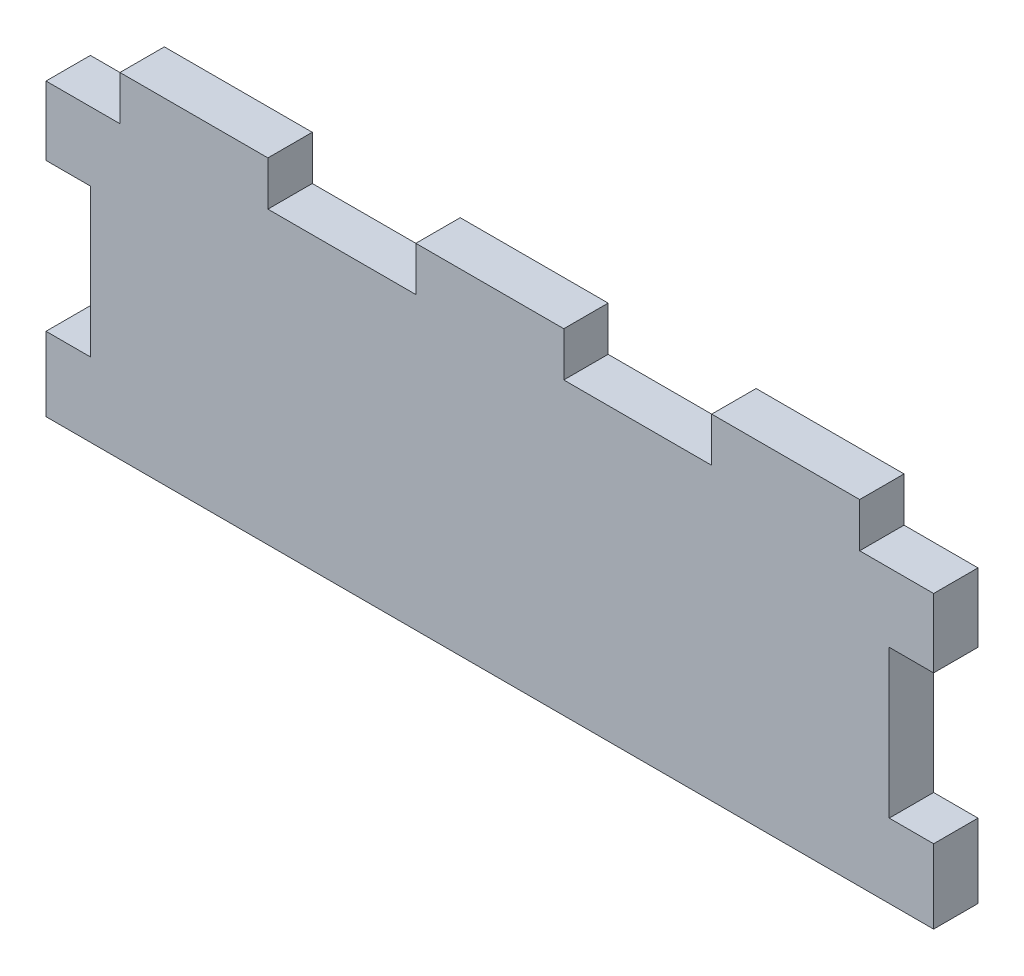
ISO-10303-21;
HEADER;
FILE_DESCRIPTION(('STEP AP214'),'2;1');
FILE_NAME('part.step','',(''),(''),'','','');
FILE_SCHEMA(('AUTOMOTIVE_DESIGN { 1 0 10303 214 1 1 1 1 }'));
ENDSEC;
DATA;
#1=APPLICATION_CONTEXT('core data for automotive mechanical design processes');
#2=APPLICATION_PROTOCOL_DEFINITION('international standard','automotive_design',2000,#1);
#3=PRODUCT_CONTEXT('',#1,'mechanical');
#4=PRODUCT('Part','Part','',(#3));
#5=PRODUCT_RELATED_PRODUCT_CATEGORY('part','',(#4));
#6=PRODUCT_DEFINITION_FORMATION('','',#4);
#7=PRODUCT_DEFINITION_CONTEXT('part definition',#1,'design');
#8=PRODUCT_DEFINITION('design','',#6,#7);
#9=PRODUCT_DEFINITION_SHAPE('','',#8);
#10=(LENGTH_UNIT() NAMED_UNIT(*) SI_UNIT(.MILLI.,.METRE.));
#11=(NAMED_UNIT(*) PLANE_ANGLE_UNIT() SI_UNIT($,.RADIAN.));
#12=(NAMED_UNIT(*) SI_UNIT($,.STERADIAN.) SOLID_ANGLE_UNIT());
#13=UNCERTAINTY_MEASURE_WITH_UNIT(LENGTH_MEASURE(1.E-05),#10,'distance_accuracy_value','');
#14=(GEOMETRIC_REPRESENTATION_CONTEXT(3) GLOBAL_UNCERTAINTY_ASSIGNED_CONTEXT((#13)) GLOBAL_UNIT_ASSIGNED_CONTEXT((#10,
#11,#12)) REPRESENTATION_CONTEXT('',''));
#15=CARTESIAN_POINT('',(0.,0.,0.));
#16=DIRECTION('',(0.,0.,1.));
#17=DIRECTION('',(1.,0.,0.));
#18=AXIS2_PLACEMENT_3D('',#15,#16,#17);
#19=CARTESIAN_POINT('',(0.,0.,6.));
#20=DIRECTION('',(1.,0.,0.));
#21=DIRECTION('',(0.,1.,0.));
#22=AXIS2_PLACEMENT_3D('',#19,#20,#21);
#23=PLANE('',#22);
#24=DIRECTION('',(0.,-1.,0.));
#25=VECTOR('',#24,1.);
#26=CARTESIAN_POINT('',(0.,0.,0.));
#27=LINE('',#26,#25);
#28=CARTESIAN_POINT('',(0.,-6.,0.));
#29=VERTEX_POINT('',#28);
#30=CARTESIAN_POINT('',(0.,-15.3,0.));
#31=VERTEX_POINT('',#30);
#32=EDGE_CURVE('E248',#29,#31,#27,.T.);
#33=ORIENTED_EDGE('',*,*,#32,.T.);
#34=DIRECTION('',(0.,0.,1.));
#35=VECTOR('',#34,1.);
#36=CARTESIAN_POINT('',(0.,-15.3,0.));
#37=LINE('',#36,#35);
#38=CARTESIAN_POINT('',(0.,-15.3,6.));
#39=VERTEX_POINT('',#38);
#40=EDGE_CURVE('E360',#31,#39,#37,.T.);
#41=ORIENTED_EDGE('',*,*,#40,.T.);
#42=DIRECTION('',(0.,-1.,0.));
#43=VECTOR('',#42,1.);
#44=CARTESIAN_POINT('',(0.,0.,6.));
#45=LINE('',#44,#43);
#46=CARTESIAN_POINT('',(0.,-6.,6.));
#47=VERTEX_POINT('',#46);
#48=EDGE_CURVE('E228',#47,#39,#45,.T.);
#49=ORIENTED_EDGE('',*,*,#48,.F.);
#50=DIRECTION('',(0.,0.,1.));
#51=VECTOR('',#50,1.);
#52=CARTESIAN_POINT('',(0.,-6.,0.));
#53=LINE('',#52,#51);
#54=EDGE_CURVE('E262',#29,#47,#53,.T.);
#55=ORIENTED_EDGE('',*,*,#54,.F.);
#56=EDGE_LOOP('',(#33,#41,#49,#55));
#57=FACE_BOUND('',#56,.T.);
#58=ADVANCED_FACE('F35',(#57),#23,.F.);
#59=CARTESIAN_POINT('',(120.,0.,6.));
#60=DIRECTION('',(-1.,0.,0.));
#61=DIRECTION('',(0.,0.,1.));
#62=AXIS2_PLACEMENT_3D('',#59,#60,#61);
#63=PLANE('',#62);
#64=DIRECTION('',(0.,1.,0.));
#65=VECTOR('',#64,1.);
#66=CARTESIAN_POINT('',(120.,0.,6.));
#67=LINE('',#66,#65);
#68=CARTESIAN_POINT('',(120.,-15.3,6.));
#69=VERTEX_POINT('',#68);
#70=CARTESIAN_POINT('',(120.,-5.99999999999999,6.));
#71=VERTEX_POINT('',#70);
#72=EDGE_CURVE('E258',#69,#71,#67,.T.);
#73=ORIENTED_EDGE('',*,*,#72,.F.);
#74=DIRECTION('',(0.,0.,1.));
#75=VECTOR('',#74,1.);
#76=CARTESIAN_POINT('',(120.,-15.3,0.));
#77=LINE('',#76,#75);
#78=CARTESIAN_POINT('',(120.,-15.3,0.));
#79=VERTEX_POINT('',#78);
#80=EDGE_CURVE('E335',#79,#69,#77,.T.);
#81=ORIENTED_EDGE('',*,*,#80,.F.);
#82=DIRECTION('',(0.,1.,0.));
#83=VECTOR('',#82,1.);
#84=CARTESIAN_POINT('',(120.,0.,0.));
#85=LINE('',#84,#83);
#86=CARTESIAN_POINT('',(120.,-5.99999999999999,0.));
#87=VERTEX_POINT('',#86);
#88=EDGE_CURVE('E239',#79,#87,#85,.T.);
#89=ORIENTED_EDGE('',*,*,#88,.T.);
#90=DIRECTION('',(0.,0.,1.));
#91=VECTOR('',#90,1.);
#92=CARTESIAN_POINT('',(120.,-5.99999999999999,0.));
#93=LINE('',#92,#91);
#94=EDGE_CURVE('E299',#87,#71,#93,.T.);
#95=ORIENTED_EDGE('',*,*,#94,.T.);
#96=EDGE_LOOP('',(#73,#81,#89,#95));
#97=FACE_BOUND('',#96,.T.);
#98=ADVANCED_FACE('F386',(#97),#63,.F.);
#99=CARTESIAN_POINT('',(0.,0.,6.));
#100=DIRECTION('',(0.,-1.,0.));
#101=DIRECTION('',(0.,0.,-1.));
#102=AXIS2_PLACEMENT_3D('',#99,#100,#101);
#103=PLANE('',#102);
#104=DIRECTION('',(-1.,0.,0.));
#105=VECTOR('',#104,1.);
#106=CARTESIAN_POINT('',(0.,0.,6.));
#107=LINE('',#106,#105);
#108=CARTESIAN_POINT('',(110.,0.,6.));
#109=VERTEX_POINT('',#108);
#110=CARTESIAN_POINT('',(90.,0.,6.));
#111=VERTEX_POINT('',#110);
#112=EDGE_CURVE('E216',#109,#111,#107,.T.);
#113=ORIENTED_EDGE('',*,*,#112,.F.);
#114=DIRECTION('',(0.,0.,1.));
#115=VECTOR('',#114,1.);
#116=CARTESIAN_POINT('',(110.,0.,0.));
#117=LINE('',#116,#115);
#118=CARTESIAN_POINT('',(110.,0.,0.));
#119=VERTEX_POINT('',#118);
#120=EDGE_CURVE('E200',#119,#109,#117,.T.);
#121=ORIENTED_EDGE('',*,*,#120,.F.);
#122=DIRECTION('',(-1.,0.,0.));
#123=VECTOR('',#122,1.);
#124=CARTESIAN_POINT('',(0.,0.,0.));
#125=LINE('',#124,#123);
#126=CARTESIAN_POINT('',(90.,0.,0.));
#127=VERTEX_POINT('',#126);
#128=EDGE_CURVE('E214',#119,#127,#125,.T.);
#129=ORIENTED_EDGE('',*,*,#128,.T.);
#130=DIRECTION('',(0.,0.,1.));
#131=VECTOR('',#130,1.);
#132=CARTESIAN_POINT('',(90.,0.,0.));
#133=LINE('',#132,#131);
#134=EDGE_CURVE('E287',#127,#111,#133,.T.);
#135=ORIENTED_EDGE('',*,*,#134,.T.);
#136=EDGE_LOOP('',(#113,#121,#129,#135));
#137=FACE_BOUND('',#136,.T.);
#138=ADVANCED_FACE('F212',(#137),#103,.F.);
#139=CARTESIAN_POINT('',(30.,0.,6.));
#140=VERTEX_POINT('',#139);
#141=CARTESIAN_POINT('',(10.,0.,6.));
#142=VERTEX_POINT('',#141);
#143=EDGE_CURVE('E252',#140,#142,#107,.T.);
#144=ORIENTED_EDGE('',*,*,#143,.F.);
#145=DIRECTION('',(0.,0.,1.));
#146=VECTOR('',#145,1.);
#147=CARTESIAN_POINT('',(30.,0.,0.));
#148=LINE('',#147,#146);
#149=CARTESIAN_POINT('',(30.,0.,0.));
#150=VERTEX_POINT('',#149);
#151=EDGE_CURVE('E276',#150,#140,#148,.T.);
#152=ORIENTED_EDGE('',*,*,#151,.F.);
#153=CARTESIAN_POINT('',(10.,0.,0.));
#154=VERTEX_POINT('',#153);
#155=EDGE_CURVE('E227',#150,#154,#125,.T.);
#156=ORIENTED_EDGE('',*,*,#155,.T.);
#157=DIRECTION('',(0.,0.,1.));
#158=VECTOR('',#157,1.);
#159=CARTESIAN_POINT('',(10.,0.,0.));
#160=LINE('',#159,#158);
#161=EDGE_CURVE('E267',#154,#142,#160,.T.);
#162=ORIENTED_EDGE('',*,*,#161,.T.);
#163=EDGE_LOOP('',(#144,#152,#156,#162));
#164=FACE_BOUND('',#163,.T.);
#165=ADVANCED_FACE('F430',(#164),#103,.F.);
#166=CARTESIAN_POINT('',(0.,-35.3,6.));
#167=VERTEX_POINT('',#166);
#168=CARTESIAN_POINT('',(0.,-45.3,6.));
#169=VERTEX_POINT('',#168);
#170=EDGE_CURVE('E224',#167,#169,#45,.T.);
#171=ORIENTED_EDGE('',*,*,#170,.F.);
#172=DIRECTION('',(0.,0.,1.));
#173=VECTOR('',#172,1.);
#174=CARTESIAN_POINT('',(0.,-35.3,0.));
#175=LINE('',#174,#173);
#176=CARTESIAN_POINT('',(0.,-35.3,0.));
#177=VERTEX_POINT('',#176);
#178=EDGE_CURVE('E353',#177,#167,#175,.T.);
#179=ORIENTED_EDGE('',*,*,#178,.F.);
#180=CARTESIAN_POINT('',(0.,-45.3,0.));
#181=VERTEX_POINT('',#180);
#182=EDGE_CURVE('E251',#177,#181,#27,.T.);
#183=ORIENTED_EDGE('',*,*,#182,.T.);
#184=DIRECTION('',(0.,0.,-1.));
#185=VECTOR('',#184,1.);
#186=CARTESIAN_POINT('',(0.,-45.3,6.));
#187=LINE('',#186,#185);
#188=EDGE_CURVE('E11',#169,#181,#187,.T.);
#189=ORIENTED_EDGE('',*,*,#188,.F.);
#190=EDGE_LOOP('',(#171,#179,#183,#189));
#191=FACE_BOUND('',#190,.T.);
#192=ADVANCED_FACE('F37',(#191),#23,.F.);
#193=CARTESIAN_POINT('',(0.,-45.3,6.));
#194=DIRECTION('',(0.,1.,0.));
#195=DIRECTION('',(0.,0.,1.));
#196=AXIS2_PLACEMENT_3D('',#193,#194,#195);
#197=PLANE('',#196);
#198=DIRECTION('',(1.,0.,0.));
#199=VECTOR('',#198,1.);
#200=CARTESIAN_POINT('',(0.,-45.3,0.));
#201=LINE('',#200,#199);
#202=CARTESIAN_POINT('',(120.,-45.3,0.));
#203=VERTEX_POINT('',#202);
#204=EDGE_CURVE('E245',#181,#203,#201,.T.);
#205=ORIENTED_EDGE('',*,*,#204,.T.);
#206=DIRECTION('',(0.,0.,-1.));
#207=VECTOR('',#206,1.);
#208=CARTESIAN_POINT('',(120.,-45.3,6.));
#209=LINE('',#208,#207);
#210=CARTESIAN_POINT('',(120.,-45.3,6.));
#211=VERTEX_POINT('',#210);
#212=EDGE_CURVE('E43',#211,#203,#209,.T.);
#213=ORIENTED_EDGE('',*,*,#212,.F.);
#214=DIRECTION('',(1.,0.,0.));
#215=VECTOR('',#214,1.);
#216=CARTESIAN_POINT('',(0.,-45.3,6.));
#217=LINE('',#216,#215);
#218=EDGE_CURVE('E259',#169,#211,#217,.T.);
#219=ORIENTED_EDGE('',*,*,#218,.F.);
#220=ORIENTED_EDGE('',*,*,#188,.T.);
#221=EDGE_LOOP('',(#205,#213,#219,#220));
#222=FACE_BOUND('',#221,.T.);
#223=ADVANCED_FACE('F405',(#222),#197,.F.);
#224=CARTESIAN_POINT('',(120.,-35.3,0.));
#225=VERTEX_POINT('',#224);
#226=EDGE_CURVE('E232',#203,#225,#85,.T.);
#227=ORIENTED_EDGE('',*,*,#226,.T.);
#228=DIRECTION('',(0.,0.,1.));
#229=VECTOR('',#228,1.);
#230=CARTESIAN_POINT('',(120.,-35.3,0.));
#231=LINE('',#230,#229);
#232=CARTESIAN_POINT('',(120.,-35.3,6.));
#233=VERTEX_POINT('',#232);
#234=EDGE_CURVE('E333',#225,#233,#231,.T.);
#235=ORIENTED_EDGE('',*,*,#234,.T.);
#236=EDGE_CURVE('E255',#211,#233,#67,.T.);
#237=ORIENTED_EDGE('',*,*,#236,.F.);
#238=ORIENTED_EDGE('',*,*,#212,.T.);
#239=EDGE_LOOP('',(#227,#235,#237,#238));
#240=FACE_BOUND('',#239,.T.);
#241=ADVANCED_FACE('F458',(#240),#63,.F.);
#242=CARTESIAN_POINT('',(70.,0.,6.));
#243=VERTEX_POINT('',#242);
#244=CARTESIAN_POINT('',(50.,0.,6.));
#245=VERTEX_POINT('',#244);
#246=EDGE_CURVE('E254',#243,#245,#107,.T.);
#247=ORIENTED_EDGE('',*,*,#246,.F.);
#248=DIRECTION('',(0.,0.,1.));
#249=VECTOR('',#248,1.);
#250=CARTESIAN_POINT('',(70.,0.,0.));
#251=LINE('',#250,#249);
#252=CARTESIAN_POINT('',(70.,0.,0.));
#253=VERTEX_POINT('',#252);
#254=EDGE_CURVE('E281',#253,#243,#251,.T.);
#255=ORIENTED_EDGE('',*,*,#254,.F.);
#256=CARTESIAN_POINT('',(50.,0.,0.));
#257=VERTEX_POINT('',#256);
#258=EDGE_CURVE('E225',#253,#257,#125,.T.);
#259=ORIENTED_EDGE('',*,*,#258,.T.);
#260=DIRECTION('',(0.,0.,1.));
#261=VECTOR('',#260,1.);
#262=CARTESIAN_POINT('',(50.,0.,0.));
#263=LINE('',#262,#261);
#264=EDGE_CURVE('E310',#257,#245,#263,.T.);
#265=ORIENTED_EDGE('',*,*,#264,.T.);
#266=EDGE_LOOP('',(#247,#255,#259,#265));
#267=FACE_BOUND('',#266,.T.);
#268=ADVANCED_FACE('F445',(#267),#103,.F.);
#269=CARTESIAN_POINT('',(0.,0.,6.));
#270=DIRECTION('',(0.,0.,1.));
#271=DIRECTION('',(1.,0.,0.));
#272=AXIS2_PLACEMENT_3D('',#269,#270,#271);
#273=PLANE('',#272);
#274=DIRECTION('',(-1.,0.,0.));
#275=VECTOR('',#274,1.);
#276=CARTESIAN_POINT('',(114.,-15.3,6.));
#277=LINE('',#276,#275);
#278=CARTESIAN_POINT('',(114.,-15.3,6.));
#279=VERTEX_POINT('',#278);
#280=EDGE_CURVE('E344',#69,#279,#277,.T.);
#281=ORIENTED_EDGE('',*,*,#280,.F.);
#282=ORIENTED_EDGE('',*,*,#72,.T.);
#283=DIRECTION('',(1.,0.,0.));
#284=VECTOR('',#283,1.);
#285=CARTESIAN_POINT('',(120.,-5.99999999999999,6.));
#286=LINE('',#285,#284);
#287=CARTESIAN_POINT('',(110.,-5.99999999999999,6.));
#288=VERTEX_POINT('',#287);
#289=EDGE_CURVE('E207',#288,#71,#286,.T.);
#290=ORIENTED_EDGE('',*,*,#289,.F.);
#291=DIRECTION('',(0.,-1.,0.));
#292=VECTOR('',#291,1.);
#293=CARTESIAN_POINT('',(110.,0.,6.));
#294=LINE('',#293,#292);
#295=EDGE_CURVE('E363',#109,#288,#294,.T.);
#296=ORIENTED_EDGE('',*,*,#295,.F.);
#297=ORIENTED_EDGE('',*,*,#112,.T.);
#298=DIRECTION('',(0.,1.,0.));
#299=VECTOR('',#298,1.);
#300=CARTESIAN_POINT('',(90.,0.,6.));
#301=LINE('',#300,#299);
#302=CARTESIAN_POINT('',(90.,-5.99999999999999,6.));
#303=VERTEX_POINT('',#302);
#304=EDGE_CURVE('E290',#303,#111,#301,.T.);
#305=ORIENTED_EDGE('',*,*,#304,.F.);
#306=DIRECTION('',(1.,0.,0.));
#307=VECTOR('',#306,1.);
#308=CARTESIAN_POINT('',(90.,-5.99999999999999,6.));
#309=LINE('',#308,#307);
#310=CARTESIAN_POINT('',(70.,-6.,6.));
#311=VERTEX_POINT('',#310);
#312=EDGE_CURVE('E293',#311,#303,#309,.T.);
#313=ORIENTED_EDGE('',*,*,#312,.F.);
#314=DIRECTION('',(0.,-1.,0.));
#315=VECTOR('',#314,1.);
#316=CARTESIAN_POINT('',(70.,0.,6.));
#317=LINE('',#316,#315);
#318=EDGE_CURVE('E296',#243,#311,#317,.T.);
#319=ORIENTED_EDGE('',*,*,#318,.F.);
#320=ORIENTED_EDGE('',*,*,#246,.T.);
#321=DIRECTION('',(0.,1.,0.));
#322=VECTOR('',#321,1.);
#323=CARTESIAN_POINT('',(50.,0.,6.));
#324=LINE('',#323,#322);
#325=CARTESIAN_POINT('',(50.,-6.,6.));
#326=VERTEX_POINT('',#325);
#327=EDGE_CURVE('E314',#326,#245,#324,.T.);
#328=ORIENTED_EDGE('',*,*,#327,.F.);
#329=DIRECTION('',(1.,0.,0.));
#330=VECTOR('',#329,1.);
#331=CARTESIAN_POINT('',(30.,-6.,6.));
#332=LINE('',#331,#330);
#333=CARTESIAN_POINT('',(30.,-6.,6.));
#334=VERTEX_POINT('',#333);
#335=EDGE_CURVE('E317',#334,#326,#332,.T.);
#336=ORIENTED_EDGE('',*,*,#335,.F.);
#337=DIRECTION('',(0.,-1.,0.));
#338=VECTOR('',#337,1.);
#339=CARTESIAN_POINT('',(30.,0.,6.));
#340=LINE('',#339,#338);
#341=EDGE_CURVE('E289',#140,#334,#340,.T.);
#342=ORIENTED_EDGE('',*,*,#341,.F.);
#343=ORIENTED_EDGE('',*,*,#143,.T.);
#344=DIRECTION('',(0.,1.,0.));
#345=VECTOR('',#344,1.);
#346=CARTESIAN_POINT('',(10.,0.,6.));
#347=LINE('',#346,#345);
#348=CARTESIAN_POINT('',(10.,-6.,6.));
#349=VERTEX_POINT('',#348);
#350=EDGE_CURVE('E269',#349,#142,#347,.T.);
#351=ORIENTED_EDGE('',*,*,#350,.F.);
#352=DIRECTION('',(1.,0.,0.));
#353=VECTOR('',#352,1.);
#354=CARTESIAN_POINT('',(0.,-6.,6.));
#355=LINE('',#354,#353);
#356=EDGE_CURVE('E273',#47,#349,#355,.T.);
#357=ORIENTED_EDGE('',*,*,#356,.F.);
#358=ORIENTED_EDGE('',*,*,#48,.T.);
#359=DIRECTION('',(-1.,0.,0.));
#360=VECTOR('',#359,1.);
#361=CARTESIAN_POINT('',(0.,-15.3,6.));
#362=LINE('',#361,#360);
#363=CARTESIAN_POINT('',(6.,-15.3,6.));
#364=VERTEX_POINT('',#363);
#365=EDGE_CURVE('E364',#364,#39,#362,.T.);
#366=ORIENTED_EDGE('',*,*,#365,.F.);
#367=DIRECTION('',(0.,1.,0.));
#368=VECTOR('',#367,1.);
#369=CARTESIAN_POINT('',(6.,-15.3,6.));
#370=LINE('',#369,#368);
#371=CARTESIAN_POINT('',(6.,-35.3,6.));
#372=VERTEX_POINT('',#371);
#373=EDGE_CURVE('E367',#372,#364,#370,.T.);
#374=ORIENTED_EDGE('',*,*,#373,.F.);
#375=DIRECTION('',(1.,0.,0.));
#376=VECTOR('',#375,1.);
#377=CARTESIAN_POINT('',(0.,-35.3,6.));
#378=LINE('',#377,#376);
#379=EDGE_CURVE('E337',#167,#372,#378,.T.);
#380=ORIENTED_EDGE('',*,*,#379,.F.);
#381=ORIENTED_EDGE('',*,*,#170,.T.);
#382=ORIENTED_EDGE('',*,*,#218,.T.);
#383=ORIENTED_EDGE('',*,*,#236,.T.);
#384=DIRECTION('',(1.,0.,0.));
#385=VECTOR('',#384,1.);
#386=CARTESIAN_POINT('',(120.,-35.3,6.));
#387=LINE('',#386,#385);
#388=CARTESIAN_POINT('',(114.,-35.3,6.));
#389=VERTEX_POINT('',#388);
#390=EDGE_CURVE('E338',#389,#233,#387,.T.);
#391=ORIENTED_EDGE('',*,*,#390,.F.);
#392=DIRECTION('',(0.,-1.,0.));
#393=VECTOR('',#392,1.);
#394=CARTESIAN_POINT('',(114.,-15.3,6.));
#395=LINE('',#394,#393);
#396=EDGE_CURVE('E341',#279,#389,#395,.T.);
#397=ORIENTED_EDGE('',*,*,#396,.F.);
#398=EDGE_LOOP('',(#281,#282,#290,#296,#297,#305,#313,#319,#320,#328,#336,#342,#343,#351,#357,
#358,#366,#374,#380,#381,#382,#383,#391,#397));
#399=FACE_BOUND('',#398,.T.);
#400=ADVANCED_FACE('F393',(#399),#273,.T.);
#401=CARTESIAN_POINT('',(0.,0.,0.));
#402=DIRECTION('',(0.,0.,1.));
#403=DIRECTION('',(1.,0.,0.));
#404=AXIS2_PLACEMENT_3D('',#401,#402,#403);
#405=PLANE('',#404);
#406=ORIENTED_EDGE('',*,*,#88,.F.);
#407=DIRECTION('',(-1.,0.,0.));
#408=VECTOR('',#407,1.);
#409=CARTESIAN_POINT('',(114.,-15.3,0.));
#410=LINE('',#409,#408);
#411=CARTESIAN_POINT('',(114.,-15.3,0.));
#412=VERTEX_POINT('',#411);
#413=EDGE_CURVE('E340',#79,#412,#410,.T.);
#414=ORIENTED_EDGE('',*,*,#413,.T.);
#415=DIRECTION('',(0.,-1.,0.));
#416=VECTOR('',#415,1.);
#417=CARTESIAN_POINT('',(114.,-15.3,0.));
#418=LINE('',#417,#416);
#419=CARTESIAN_POINT('',(114.,-35.3,0.));
#420=VERTEX_POINT('',#419);
#421=EDGE_CURVE('E348',#412,#420,#418,.T.);
#422=ORIENTED_EDGE('',*,*,#421,.T.);
#423=DIRECTION('',(1.,0.,0.));
#424=VECTOR('',#423,1.);
#425=CARTESIAN_POINT('',(120.,-35.3,0.));
#426=LINE('',#425,#424);
#427=EDGE_CURVE('E50',#420,#225,#426,.T.);
#428=ORIENTED_EDGE('',*,*,#427,.T.);
#429=ORIENTED_EDGE('',*,*,#226,.F.);
#430=ORIENTED_EDGE('',*,*,#204,.F.);
#431=ORIENTED_EDGE('',*,*,#182,.F.);
#432=DIRECTION('',(1.,0.,0.));
#433=VECTOR('',#432,1.);
#434=CARTESIAN_POINT('',(0.,-35.3,0.));
#435=LINE('',#434,#433);
#436=CARTESIAN_POINT('',(6.,-35.3,0.));
#437=VERTEX_POINT('',#436);
#438=EDGE_CURVE('E366',#177,#437,#435,.T.);
#439=ORIENTED_EDGE('',*,*,#438,.T.);
#440=DIRECTION('',(0.,1.,0.));
#441=VECTOR('',#440,1.);
#442=CARTESIAN_POINT('',(6.,-15.3,0.));
#443=LINE('',#442,#441);
#444=CARTESIAN_POINT('',(6.,-15.3,0.));
#445=VERTEX_POINT('',#444);
#446=EDGE_CURVE('E58',#437,#445,#443,.T.);
#447=ORIENTED_EDGE('',*,*,#446,.T.);
#448=DIRECTION('',(-1.,0.,0.));
#449=VECTOR('',#448,1.);
#450=CARTESIAN_POINT('',(0.,-15.3,0.));
#451=LINE('',#450,#449);
#452=EDGE_CURVE('E356',#445,#31,#451,.T.);
#453=ORIENTED_EDGE('',*,*,#452,.T.);
#454=ORIENTED_EDGE('',*,*,#32,.F.);
#455=DIRECTION('',(1.,0.,0.));
#456=VECTOR('',#455,1.);
#457=CARTESIAN_POINT('',(0.,-6.,0.));
#458=LINE('',#457,#456);
#459=CARTESIAN_POINT('',(10.,-6.,0.));
#460=VERTEX_POINT('',#459);
#461=EDGE_CURVE('E272',#29,#460,#458,.T.);
#462=ORIENTED_EDGE('',*,*,#461,.T.);
#463=DIRECTION('',(0.,1.,0.));
#464=VECTOR('',#463,1.);
#465=CARTESIAN_POINT('',(10.,0.,0.));
#466=LINE('',#465,#464);
#467=EDGE_CURVE('E265',#460,#154,#466,.T.);
#468=ORIENTED_EDGE('',*,*,#467,.T.);
#469=ORIENTED_EDGE('',*,*,#155,.F.);
#470=DIRECTION('',(0.,-1.,0.));
#471=VECTOR('',#470,1.);
#472=CARTESIAN_POINT('',(30.,0.,0.));
#473=LINE('',#472,#471);
#474=CARTESIAN_POINT('',(30.,-6.,0.));
#475=VERTEX_POINT('',#474);
#476=EDGE_CURVE('E316',#150,#475,#473,.T.);
#477=ORIENTED_EDGE('',*,*,#476,.T.);
#478=DIRECTION('',(1.,0.,0.));
#479=VECTOR('',#478,1.);
#480=CARTESIAN_POINT('',(30.,-6.,0.));
#481=LINE('',#480,#479);
#482=CARTESIAN_POINT('',(50.,-6.,0.));
#483=VERTEX_POINT('',#482);
#484=EDGE_CURVE('E324',#475,#483,#481,.T.);
#485=ORIENTED_EDGE('',*,*,#484,.T.);
#486=DIRECTION('',(0.,1.,0.));
#487=VECTOR('',#486,1.);
#488=CARTESIAN_POINT('',(50.,0.,0.));
#489=LINE('',#488,#487);
#490=EDGE_CURVE('E308',#483,#257,#489,.T.);
#491=ORIENTED_EDGE('',*,*,#490,.T.);
#492=ORIENTED_EDGE('',*,*,#258,.F.);
#493=DIRECTION('',(0.,-1.,0.));
#494=VECTOR('',#493,1.);
#495=CARTESIAN_POINT('',(70.,0.,0.));
#496=LINE('',#495,#494);
#497=CARTESIAN_POINT('',(70.,-6.,0.));
#498=VERTEX_POINT('',#497);
#499=EDGE_CURVE('E292',#253,#498,#496,.T.);
#500=ORIENTED_EDGE('',*,*,#499,.T.);
#501=DIRECTION('',(1.,0.,0.));
#502=VECTOR('',#501,1.);
#503=CARTESIAN_POINT('',(90.,-5.99999999999999,0.));
#504=LINE('',#503,#502);
#505=CARTESIAN_POINT('',(90.,-5.99999999999999,0.));
#506=VERTEX_POINT('',#505);
#507=EDGE_CURVE('E301',#498,#506,#504,.T.);
#508=ORIENTED_EDGE('',*,*,#507,.T.);
#509=DIRECTION('',(0.,1.,0.));
#510=VECTOR('',#509,1.);
#511=CARTESIAN_POINT('',(90.,0.,0.));
#512=LINE('',#511,#510);
#513=EDGE_CURVE('E223',#506,#127,#512,.T.);
#514=ORIENTED_EDGE('',*,*,#513,.T.);
#515=ORIENTED_EDGE('',*,*,#128,.F.);
#516=DIRECTION('',(0.,-1.,0.));
#517=VECTOR('',#516,1.);
#518=CARTESIAN_POINT('',(110.,0.,0.));
#519=LINE('',#518,#517);
#520=CARTESIAN_POINT('',(110.,-5.99999999999999,0.));
#521=VERTEX_POINT('',#520);
#522=EDGE_CURVE('E196',#119,#521,#519,.T.);
#523=ORIENTED_EDGE('',*,*,#522,.T.);
#524=DIRECTION('',(1.,0.,0.));
#525=VECTOR('',#524,1.);
#526=CARTESIAN_POINT('',(120.,-5.99999999999999,0.));
#527=LINE('',#526,#525);
#528=EDGE_CURVE('E206',#521,#87,#527,.T.);
#529=ORIENTED_EDGE('',*,*,#528,.T.);
#530=EDGE_LOOP('',(#406,#414,#422,#428,#429,#430,#431,#439,#447,#453,#454,#462,#468,#469,#477,
#485,#491,#492,#500,#508,#514,#515,#523,#529));
#531=FACE_BOUND('',#530,.T.);
#532=ADVANCED_FACE('F220',(#531),#405,.F.);
#533=CARTESIAN_POINT('',(10.,0.,0.));
#534=DIRECTION('',(1.,0.,0.));
#535=DIRECTION('',(0.,0.,-1.));
#536=AXIS2_PLACEMENT_3D('',#533,#534,#535);
#537=PLANE('',#536);
#538=ORIENTED_EDGE('',*,*,#350,.T.);
#539=ORIENTED_EDGE('',*,*,#161,.F.);
#540=ORIENTED_EDGE('',*,*,#467,.F.);
#541=DIRECTION('',(0.,0.,1.));
#542=VECTOR('',#541,1.);
#543=CARTESIAN_POINT('',(10.,-6.,0.));
#544=LINE('',#543,#542);
#545=EDGE_CURVE('E264',#460,#349,#544,.T.);
#546=ORIENTED_EDGE('',*,*,#545,.T.);
#547=EDGE_LOOP('',(#538,#539,#540,#546));
#548=FACE_BOUND('',#547,.T.);
#549=ADVANCED_FACE('F429',(#548),#537,.F.);
#550=CARTESIAN_POINT('',(0.,-6.,0.));
#551=DIRECTION('',(0.,-1.,0.));
#552=DIRECTION('',(0.,0.,-1.));
#553=AXIS2_PLACEMENT_3D('',#550,#551,#552);
#554=PLANE('',#553);
#555=ORIENTED_EDGE('',*,*,#356,.T.);
#556=ORIENTED_EDGE('',*,*,#545,.F.);
#557=ORIENTED_EDGE('',*,*,#461,.F.);
#558=ORIENTED_EDGE('',*,*,#54,.T.);
#559=EDGE_LOOP('',(#555,#556,#557,#558));
#560=FACE_BOUND('',#559,.T.);
#561=ADVANCED_FACE('F423',(#560),#554,.F.);
#562=CARTESIAN_POINT('',(30.,0.,0.));
#563=DIRECTION('',(-1.,0.,0.));
#564=DIRECTION('',(0.,0.,1.));
#565=AXIS2_PLACEMENT_3D('',#562,#563,#564);
#566=PLANE('',#565);
#567=ORIENTED_EDGE('',*,*,#341,.T.);
#568=DIRECTION('',(0.,0.,1.));
#569=VECTOR('',#568,1.);
#570=CARTESIAN_POINT('',(30.,-6.,0.));
#571=LINE('',#570,#569);
#572=EDGE_CURVE('E305',#475,#334,#571,.T.);
#573=ORIENTED_EDGE('',*,*,#572,.F.);
#574=ORIENTED_EDGE('',*,*,#476,.F.);
#575=ORIENTED_EDGE('',*,*,#151,.T.);
#576=EDGE_LOOP('',(#567,#573,#574,#575));
#577=FACE_BOUND('',#576,.T.);
#578=ADVANCED_FACE('F433',(#577),#566,.F.);
#579=CARTESIAN_POINT('',(50.,0.,0.));
#580=DIRECTION('',(1.,0.,0.));
#581=DIRECTION('',(0.,0.,-1.));
#582=AXIS2_PLACEMENT_3D('',#579,#580,#581);
#583=PLANE('',#582);
#584=ORIENTED_EDGE('',*,*,#327,.T.);
#585=ORIENTED_EDGE('',*,*,#264,.F.);
#586=ORIENTED_EDGE('',*,*,#490,.F.);
#587=DIRECTION('',(0.,0.,1.));
#588=VECTOR('',#587,1.);
#589=CARTESIAN_POINT('',(50.,-6.,0.));
#590=LINE('',#589,#588);
#591=EDGE_CURVE('E307',#483,#326,#590,.T.);
#592=ORIENTED_EDGE('',*,*,#591,.T.);
#593=EDGE_LOOP('',(#584,#585,#586,#592));
#594=FACE_BOUND('',#593,.T.);
#595=ADVANCED_FACE('F440',(#594),#583,.F.);
#596=CARTESIAN_POINT('',(30.,-6.,0.));
#597=DIRECTION('',(0.,-1.,0.));
#598=DIRECTION('',(0.,0.,-1.));
#599=AXIS2_PLACEMENT_3D('',#596,#597,#598);
#600=PLANE('',#599);
#601=ORIENTED_EDGE('',*,*,#335,.T.);
#602=ORIENTED_EDGE('',*,*,#591,.F.);
#603=ORIENTED_EDGE('',*,*,#484,.F.);
#604=ORIENTED_EDGE('',*,*,#572,.T.);
#605=EDGE_LOOP('',(#601,#602,#603,#604));
#606=FACE_BOUND('',#605,.T.);
#607=ADVANCED_FACE('F437',(#606),#600,.F.);
#608=CARTESIAN_POINT('',(90.,0.,0.));
#609=DIRECTION('',(1.,0.,0.));
#610=DIRECTION('',(0.,0.,-1.));
#611=AXIS2_PLACEMENT_3D('',#608,#609,#610);
#612=PLANE('',#611);
#613=ORIENTED_EDGE('',*,*,#304,.T.);
#614=ORIENTED_EDGE('',*,*,#134,.F.);
#615=ORIENTED_EDGE('',*,*,#513,.F.);
#616=DIRECTION('',(0.,0.,1.));
#617=VECTOR('',#616,1.);
#618=CARTESIAN_POINT('',(90.,-5.99999999999999,0.));
#619=LINE('',#618,#617);
#620=EDGE_CURVE('E285',#506,#303,#619,.T.);
#621=ORIENTED_EDGE('',*,*,#620,.T.);
#622=EDGE_LOOP('',(#613,#614,#615,#621));
#623=FACE_BOUND('',#622,.T.);
#624=ADVANCED_FACE('F456',(#623),#612,.F.);
#625=CARTESIAN_POINT('',(90.,-5.99999999999999,0.));
#626=DIRECTION('',(0.,-1.,0.));
#627=DIRECTION('',(1.,0.,0.));
#628=AXIS2_PLACEMENT_3D('',#625,#626,#627);
#629=PLANE('',#628);
#630=ORIENTED_EDGE('',*,*,#312,.T.);
#631=ORIENTED_EDGE('',*,*,#620,.F.);
#632=ORIENTED_EDGE('',*,*,#507,.F.);
#633=DIRECTION('',(0.,0.,1.));
#634=VECTOR('',#633,1.);
#635=CARTESIAN_POINT('',(70.,-6.,0.));
#636=LINE('',#635,#634);
#637=EDGE_CURVE('E283',#498,#311,#636,.T.);
#638=ORIENTED_EDGE('',*,*,#637,.T.);
#639=EDGE_LOOP('',(#630,#631,#632,#638));
#640=FACE_BOUND('',#639,.T.);
#641=ADVANCED_FACE('F454',(#640),#629,.F.);
#642=CARTESIAN_POINT('',(70.,0.,0.));
#643=DIRECTION('',(-1.,0.,0.));
#644=DIRECTION('',(0.,0.,1.));
#645=AXIS2_PLACEMENT_3D('',#642,#643,#644);
#646=PLANE('',#645);
#647=ORIENTED_EDGE('',*,*,#318,.T.);
#648=ORIENTED_EDGE('',*,*,#637,.F.);
#649=ORIENTED_EDGE('',*,*,#499,.F.);
#650=ORIENTED_EDGE('',*,*,#254,.T.);
#651=EDGE_LOOP('',(#647,#648,#649,#650));
#652=FACE_BOUND('',#651,.T.);
#653=ADVANCED_FACE('F449',(#652),#646,.F.);
#654=CARTESIAN_POINT('',(120.,-5.99999999999999,0.));
#655=DIRECTION('',(0.,-1.,0.));
#656=DIRECTION('',(1.,0.,0.));
#657=AXIS2_PLACEMENT_3D('',#654,#655,#656);
#658=PLANE('',#657);
#659=ORIENTED_EDGE('',*,*,#289,.T.);
#660=ORIENTED_EDGE('',*,*,#94,.F.);
#661=ORIENTED_EDGE('',*,*,#528,.F.);
#662=DIRECTION('',(0.,0.,1.));
#663=VECTOR('',#662,1.);
#664=CARTESIAN_POINT('',(110.,-5.99999999999999,0.));
#665=LINE('',#664,#663);
#666=EDGE_CURVE('E202',#521,#288,#665,.T.);
#667=ORIENTED_EDGE('',*,*,#666,.T.);
#668=EDGE_LOOP('',(#659,#660,#661,#667));
#669=FACE_BOUND('',#668,.T.);
#670=ADVANCED_FACE('F589',(#669),#658,.F.);
#671=CARTESIAN_POINT('',(110.,0.,0.));
#672=DIRECTION('',(-1.,0.,0.));
#673=DIRECTION('',(0.,0.,1.));
#674=AXIS2_PLACEMENT_3D('',#671,#672,#673);
#675=PLANE('',#674);
#676=ORIENTED_EDGE('',*,*,#295,.T.);
#677=ORIENTED_EDGE('',*,*,#666,.F.);
#678=ORIENTED_EDGE('',*,*,#522,.F.);
#679=ORIENTED_EDGE('',*,*,#120,.T.);
#680=EDGE_LOOP('',(#676,#677,#678,#679));
#681=FACE_BOUND('',#680,.T.);
#682=ADVANCED_FACE('F199',(#681),#675,.F.);
#683=CARTESIAN_POINT('',(0.,-15.3,0.));
#684=DIRECTION('',(0.,1.,0.));
#685=DIRECTION('',(0.,0.,1.));
#686=AXIS2_PLACEMENT_3D('',#683,#684,#685);
#687=PLANE('',#686);
#688=ORIENTED_EDGE('',*,*,#365,.T.);
#689=ORIENTED_EDGE('',*,*,#40,.F.);
#690=ORIENTED_EDGE('',*,*,#452,.F.);
#691=DIRECTION('',(0.,0.,1.));
#692=VECTOR('',#691,1.);
#693=CARTESIAN_POINT('',(6.,-15.3,0.));
#694=LINE('',#693,#692);
#695=EDGE_CURVE('E358',#445,#364,#694,.T.);
#696=ORIENTED_EDGE('',*,*,#695,.T.);
#697=EDGE_LOOP('',(#688,#689,#690,#696));
#698=FACE_BOUND('',#697,.T.);
#699=ADVANCED_FACE('F602',(#698),#687,.F.);
#700=CARTESIAN_POINT('',(6.,-15.3,0.));
#701=DIRECTION('',(1.,0.,0.));
#702=DIRECTION('',(0.,1.,0.));
#703=AXIS2_PLACEMENT_3D('',#700,#701,#702);
#704=PLANE('',#703);
#705=ORIENTED_EDGE('',*,*,#373,.T.);
#706=ORIENTED_EDGE('',*,*,#695,.F.);
#707=ORIENTED_EDGE('',*,*,#446,.F.);
#708=DIRECTION('',(0.,0.,1.));
#709=VECTOR('',#708,1.);
#710=CARTESIAN_POINT('',(6.,-35.3,0.));
#711=LINE('',#710,#709);
#712=EDGE_CURVE('E355',#437,#372,#711,.T.);
#713=ORIENTED_EDGE('',*,*,#712,.T.);
#714=EDGE_LOOP('',(#705,#706,#707,#713));
#715=FACE_BOUND('',#714,.T.);
#716=ADVANCED_FACE('F414',(#715),#704,.F.);
#717=CARTESIAN_POINT('',(0.,-35.3,0.));
#718=DIRECTION('',(0.,-1.,0.));
#719=DIRECTION('',(0.,0.,-1.));
#720=AXIS2_PLACEMENT_3D('',#717,#718,#719);
#721=PLANE('',#720);
#722=ORIENTED_EDGE('',*,*,#379,.T.);
#723=ORIENTED_EDGE('',*,*,#712,.F.);
#724=ORIENTED_EDGE('',*,*,#438,.F.);
#725=ORIENTED_EDGE('',*,*,#178,.T.);
#726=EDGE_LOOP('',(#722,#723,#724,#725));
#727=FACE_BOUND('',#726,.T.);
#728=ADVANCED_FACE('F411',(#727),#721,.F.);
#729=CARTESIAN_POINT('',(114.,-15.3,0.));
#730=DIRECTION('',(0.,1.,0.));
#731=DIRECTION('',(0.,0.,1.));
#732=AXIS2_PLACEMENT_3D('',#729,#730,#731);
#733=PLANE('',#732);
#734=ORIENTED_EDGE('',*,*,#280,.T.);
#735=DIRECTION('',(0.,0.,1.));
#736=VECTOR('',#735,1.);
#737=CARTESIAN_POINT('',(114.,-15.3,0.));
#738=LINE('',#737,#736);
#739=EDGE_CURVE('E329',#412,#279,#738,.T.);
#740=ORIENTED_EDGE('',*,*,#739,.F.);
#741=ORIENTED_EDGE('',*,*,#413,.F.);
#742=ORIENTED_EDGE('',*,*,#80,.T.);
#743=EDGE_LOOP('',(#734,#740,#741,#742));
#744=FACE_BOUND('',#743,.T.);
#745=ADVANCED_FACE('F390',(#744),#733,.F.);
#746=CARTESIAN_POINT('',(120.,-35.3,0.));
#747=DIRECTION('',(0.,-1.,0.));
#748=DIRECTION('',(0.,0.,-1.));
#749=AXIS2_PLACEMENT_3D('',#746,#747,#748);
#750=PLANE('',#749);
#751=ORIENTED_EDGE('',*,*,#390,.T.);
#752=ORIENTED_EDGE('',*,*,#234,.F.);
#753=ORIENTED_EDGE('',*,*,#427,.F.);
#754=DIRECTION('',(0.,0.,1.));
#755=VECTOR('',#754,1.);
#756=CARTESIAN_POINT('',(114.,-35.3,0.));
#757=LINE('',#756,#755);
#758=EDGE_CURVE('E331',#420,#389,#757,.T.);
#759=ORIENTED_EDGE('',*,*,#758,.T.);
#760=EDGE_LOOP('',(#751,#752,#753,#759));
#761=FACE_BOUND('',#760,.T.);
#762=ADVANCED_FACE('F459',(#761),#750,.F.);
#763=CARTESIAN_POINT('',(114.,-15.3,0.));
#764=DIRECTION('',(-1.,0.,0.));
#765=DIRECTION('',(0.,0.,1.));
#766=AXIS2_PLACEMENT_3D('',#763,#764,#765);
#767=PLANE('',#766);
#768=ORIENTED_EDGE('',*,*,#396,.T.);
#769=ORIENTED_EDGE('',*,*,#758,.F.);
#770=ORIENTED_EDGE('',*,*,#421,.F.);
#771=ORIENTED_EDGE('',*,*,#739,.T.);
#772=EDGE_LOOP('',(#768,#769,#770,#771));
#773=FACE_BOUND('',#772,.T.);
#774=ADVANCED_FACE('F397',(#773),#767,.F.);
#775=CLOSED_SHELL('',(#58,#98,#138,#165,#192,#223,#241,#268,#400,#532,#549,#561,#578,#595,#607,
#624,#641,#653,#670,#682,#699,#716,#728,#745,#762,#774));
#776=MANIFOLD_SOLID_BREP('B2',#775);
#777=ADVANCED_BREP_SHAPE_REPRESENTATION('',(#18,#776),#14);
#778=SHAPE_DEFINITION_REPRESENTATION(#9,#777);
ENDSEC;
END-ISO-10303-21;
